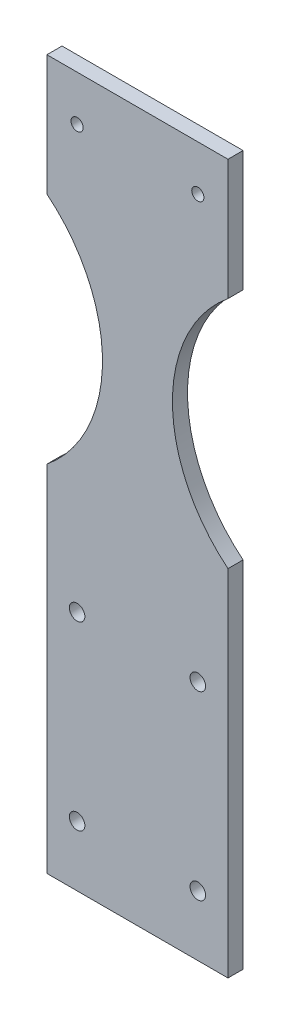
ISO-10303-21;
HEADER;
FILE_DESCRIPTION(('STEP AP214'),'2;1');
FILE_NAME('part.step','',(''),(''),'','','');
FILE_SCHEMA(('AUTOMOTIVE_DESIGN { 1 0 10303 214 1 1 1 1 }'));
ENDSEC;
DATA;
#1=APPLICATION_CONTEXT('core data for automotive mechanical design processes');
#2=APPLICATION_PROTOCOL_DEFINITION('international standard','automotive_design',2000,#1);
#3=PRODUCT_CONTEXT('',#1,'mechanical');
#4=PRODUCT('Part','Part','',(#3));
#5=PRODUCT_RELATED_PRODUCT_CATEGORY('part','',(#4));
#6=PRODUCT_DEFINITION_FORMATION('','',#4);
#7=PRODUCT_DEFINITION_CONTEXT('part definition',#1,'design');
#8=PRODUCT_DEFINITION('design','',#6,#7);
#9=PRODUCT_DEFINITION_SHAPE('','',#8);
#10=(LENGTH_UNIT() NAMED_UNIT(*) SI_UNIT(.MILLI.,.METRE.));
#11=(NAMED_UNIT(*) PLANE_ANGLE_UNIT() SI_UNIT($,.RADIAN.));
#12=(NAMED_UNIT(*) SI_UNIT($,.STERADIAN.) SOLID_ANGLE_UNIT());
#13=UNCERTAINTY_MEASURE_WITH_UNIT(LENGTH_MEASURE(1.E-05),#10,'distance_accuracy_value','');
#14=(GEOMETRIC_REPRESENTATION_CONTEXT(3) GLOBAL_UNCERTAINTY_ASSIGNED_CONTEXT((#13)) GLOBAL_UNIT_ASSIGNED_CONTEXT((#10,
#11,#12)) REPRESENTATION_CONTEXT('',''));
#15=CARTESIAN_POINT('',(0.,0.,0.));
#16=DIRECTION('',(0.,0.,1.));
#17=DIRECTION('',(1.,0.,0.));
#18=AXIS2_PLACEMENT_3D('',#15,#16,#17);
#19=CARTESIAN_POINT('',(-38.1,-149.225,6.35));
#20=DIRECTION('',(1.,0.,0.));
#21=DIRECTION('',(0.,0.,-1.));
#22=AXIS2_PLACEMENT_3D('',#19,#20,#21);
#23=PLANE('',#22);
#24=DIRECTION('',(0.,-1.,0.));
#25=VECTOR('',#24,1.);
#26=CARTESIAN_POINT('',(-38.1,-149.225,6.35));
#27=LINE('',#26,#25);
#28=CARTESIAN_POINT('',(-38.1,0.,6.35));
#29=VERTEX_POINT('',#28);
#30=CARTESIAN_POINT('',(-38.1,-149.225,6.35));
#31=VERTEX_POINT('',#30);
#32=EDGE_CURVE('E109',#29,#31,#27,.T.);
#33=ORIENTED_EDGE('',*,*,#32,.F.);
#34=DIRECTION('',(0.,0.,-1.));
#35=VECTOR('',#34,1.);
#36=CARTESIAN_POINT('',(-38.1,0.,6.35));
#37=LINE('',#36,#35);
#38=CARTESIAN_POINT('',(-38.1,0.,0.));
#39=VERTEX_POINT('',#38);
#40=EDGE_CURVE('E97',#29,#39,#37,.T.);
#41=ORIENTED_EDGE('',*,*,#40,.T.);
#42=DIRECTION('',(0.,-1.,0.));
#43=VECTOR('',#42,1.);
#44=CARTESIAN_POINT('',(-38.1,-149.225,0.));
#45=LINE('',#44,#43);
#46=CARTESIAN_POINT('',(-38.1,-149.225,0.));
#47=VERTEX_POINT('',#46);
#48=EDGE_CURVE('E132',#39,#47,#45,.T.);
#49=ORIENTED_EDGE('',*,*,#48,.T.);
#50=DIRECTION('',(0.,0.,-1.));
#51=VECTOR('',#50,1.);
#52=CARTESIAN_POINT('',(-38.1,-149.225,6.35));
#53=LINE('',#52,#51);
#54=EDGE_CURVE('E115',#31,#47,#53,.T.);
#55=ORIENTED_EDGE('',*,*,#54,.F.);
#56=EDGE_LOOP('',(#33,#41,#49,#55));
#57=FACE_BOUND('',#56,.T.);
#58=ADVANCED_FACE('F34',(#57),#23,.F.);
#59=CARTESIAN_POINT('',(38.1,-149.225,6.35));
#60=DIRECTION('',(-1.,0.,0.));
#61=DIRECTION('',(0.,0.,1.));
#62=AXIS2_PLACEMENT_3D('',#59,#60,#61);
#63=PLANE('',#62);
#64=DIRECTION('',(0.,1.,0.));
#65=VECTOR('',#64,1.);
#66=CARTESIAN_POINT('',(38.1,-149.225,6.35));
#67=LINE('',#66,#65);
#68=CARTESIAN_POINT('',(38.1000000000001,98.425,6.35));
#69=VERTEX_POINT('',#68);
#70=CARTESIAN_POINT('',(38.1,149.225,6.35));
#71=VERTEX_POINT('',#70);
#72=EDGE_CURVE('E138',#69,#71,#67,.T.);
#73=ORIENTED_EDGE('',*,*,#72,.F.);
#74=DIRECTION('',(0.,0.,-1.));
#75=VECTOR('',#74,1.);
#76=CARTESIAN_POINT('',(38.1000000000001,98.425,6.35));
#77=LINE('',#76,#75);
#78=CARTESIAN_POINT('',(38.1000000000001,98.425,0.));
#79=VERTEX_POINT('',#78);
#80=EDGE_CURVE('E165',#69,#79,#77,.T.);
#81=ORIENTED_EDGE('',*,*,#80,.T.);
#82=DIRECTION('',(0.,1.,0.));
#83=VECTOR('',#82,1.);
#84=CARTESIAN_POINT('',(38.1,-149.225,0.));
#85=LINE('',#84,#83);
#86=CARTESIAN_POINT('',(38.1,149.225,0.));
#87=VERTEX_POINT('',#86);
#88=EDGE_CURVE('E130',#79,#87,#85,.T.);
#89=ORIENTED_EDGE('',*,*,#88,.T.);
#90=DIRECTION('',(0.,0.,-1.));
#91=VECTOR('',#90,1.);
#92=CARTESIAN_POINT('',(38.1,149.225,6.35));
#93=LINE('',#92,#91);
#94=EDGE_CURVE('E11',#71,#87,#93,.T.);
#95=ORIENTED_EDGE('',*,*,#94,.F.);
#96=EDGE_LOOP('',(#73,#81,#89,#95));
#97=FACE_BOUND('',#96,.T.);
#98=ADVANCED_FACE('F187',(#97),#63,.F.);
#99=CARTESIAN_POINT('',(38.1,-149.225,0.));
#100=VERTEX_POINT('',#99);
#101=CARTESIAN_POINT('',(38.1,0.,0.));
#102=VERTEX_POINT('',#101);
#103=EDGE_CURVE('E126',#100,#102,#85,.T.);
#104=ORIENTED_EDGE('',*,*,#103,.T.);
#105=DIRECTION('',(0.,0.,-1.));
#106=VECTOR('',#105,1.);
#107=CARTESIAN_POINT('',(38.1,0.,6.35));
#108=LINE('',#107,#106);
#109=CARTESIAN_POINT('',(38.1,0.,6.35));
#110=VERTEX_POINT('',#109);
#111=EDGE_CURVE('E57',#110,#102,#108,.T.);
#112=ORIENTED_EDGE('',*,*,#111,.F.);
#113=CARTESIAN_POINT('',(38.1,-149.225,6.35));
#114=VERTEX_POINT('',#113);
#115=EDGE_CURVE('E120',#114,#110,#67,.T.);
#116=ORIENTED_EDGE('',*,*,#115,.F.);
#117=DIRECTION('',(0.,0.,-1.));
#118=VECTOR('',#117,1.);
#119=CARTESIAN_POINT('',(38.1,-149.225,6.35));
#120=LINE('',#119,#118);
#121=EDGE_CURVE('E125',#114,#100,#120,.T.);
#122=ORIENTED_EDGE('',*,*,#121,.T.);
#123=EDGE_LOOP('',(#104,#112,#116,#122));
#124=FACE_BOUND('',#123,.T.);
#125=ADVANCED_FACE('F36',(#124),#63,.F.);
#126=CARTESIAN_POINT('',(-38.1,149.225,6.35));
#127=DIRECTION('',(0.,-1.,0.));
#128=DIRECTION('',(0.,0.,-1.));
#129=AXIS2_PLACEMENT_3D('',#126,#127,#128);
#130=PLANE('',#129);
#131=DIRECTION('',(-1.,0.,0.));
#132=VECTOR('',#131,1.);
#133=CARTESIAN_POINT('',(-38.1,149.225,0.));
#134=LINE('',#133,#132);
#135=CARTESIAN_POINT('',(-38.1,149.225,0.));
#136=VERTEX_POINT('',#135);
#137=EDGE_CURVE('E129',#87,#136,#134,.T.);
#138=ORIENTED_EDGE('',*,*,#137,.T.);
#139=DIRECTION('',(0.,0.,-1.));
#140=VECTOR('',#139,1.);
#141=CARTESIAN_POINT('',(-38.1,149.225,6.35));
#142=LINE('',#141,#140);
#143=CARTESIAN_POINT('',(-38.1,149.225,6.35));
#144=VERTEX_POINT('',#143);
#145=EDGE_CURVE('E42',#144,#136,#142,.T.);
#146=ORIENTED_EDGE('',*,*,#145,.F.);
#147=DIRECTION('',(-1.,0.,0.));
#148=VECTOR('',#147,1.);
#149=CARTESIAN_POINT('',(-38.1,149.225,6.35));
#150=LINE('',#149,#148);
#151=EDGE_CURVE('E117',#71,#144,#150,.T.);
#152=ORIENTED_EDGE('',*,*,#151,.F.);
#153=ORIENTED_EDGE('',*,*,#94,.T.);
#154=EDGE_LOOP('',(#138,#146,#152,#153));
#155=FACE_BOUND('',#154,.T.);
#156=ADVANCED_FACE('F186',(#155),#130,.F.);
#157=CARTESIAN_POINT('',(-38.1,98.425,0.));
#158=VERTEX_POINT('',#157);
#159=EDGE_CURVE('E133',#136,#158,#45,.T.);
#160=ORIENTED_EDGE('',*,*,#159,.T.);
#161=DIRECTION('',(0.,0.,-1.));
#162=VECTOR('',#161,1.);
#163=CARTESIAN_POINT('',(-38.1,98.425,6.35));
#164=LINE('',#163,#162);
#165=CARTESIAN_POINT('',(-38.1,98.425,6.35));
#166=VERTEX_POINT('',#165);
#167=EDGE_CURVE('E49',#166,#158,#164,.T.);
#168=ORIENTED_EDGE('',*,*,#167,.F.);
#169=EDGE_CURVE('E112',#144,#166,#27,.T.);
#170=ORIENTED_EDGE('',*,*,#169,.F.);
#171=ORIENTED_EDGE('',*,*,#145,.T.);
#172=EDGE_LOOP('',(#160,#168,#170,#171));
#173=FACE_BOUND('',#172,.T.);
#174=ADVANCED_FACE('F145',(#173),#23,.F.);
#175=CARTESIAN_POINT('',(-38.1,-149.225,6.35));
#176=DIRECTION('',(0.,1.,0.));
#177=DIRECTION('',(0.,0.,1.));
#178=AXIS2_PLACEMENT_3D('',#175,#176,#177);
#179=PLANE('',#178);
#180=DIRECTION('',(1.,0.,0.));
#181=VECTOR('',#180,1.);
#182=CARTESIAN_POINT('',(-38.1,-149.225,0.));
#183=LINE('',#182,#181);
#184=EDGE_CURVE('E136',#47,#100,#183,.T.);
#185=ORIENTED_EDGE('',*,*,#184,.T.);
#186=ORIENTED_EDGE('',*,*,#121,.F.);
#187=DIRECTION('',(1.,0.,0.));
#188=VECTOR('',#187,1.);
#189=CARTESIAN_POINT('',(-38.1,-149.225,6.35));
#190=LINE('',#189,#188);
#191=EDGE_CURVE('E119',#31,#114,#190,.T.);
#192=ORIENTED_EDGE('',*,*,#191,.F.);
#193=ORIENTED_EDGE('',*,*,#54,.T.);
#194=EDGE_LOOP('',(#185,#186,#192,#193));
#195=FACE_BOUND('',#194,.T.);
#196=ADVANCED_FACE('F192',(#195),#179,.F.);
#197=CARTESIAN_POINT('',(0.,0.,6.35));
#198=DIRECTION('',(0.,0.,-1.));
#199=DIRECTION('',(-1.,0.,0.));
#200=AXIS2_PLACEMENT_3D('',#197,#198,#199);
#201=PLANE('',#200);
#202=CARTESIAN_POINT('',(25.4,-47.625,6.35));
#203=DIRECTION('',(0.,0.,-1.));
#204=DIRECTION('',(-1.,0.,0.));
#205=AXIS2_PLACEMENT_3D('',#202,#203,#204);
#206=CIRCLE('',#205,3.2639);
#207=CARTESIAN_POINT('',(22.1361,-47.625,6.35));
#208=VERTEX_POINT('',#207);
#209=EDGE_CURVE('E337',#208,#208,#206,.T.);
#210=ORIENTED_EDGE('',*,*,#209,.T.);
#211=EDGE_LOOP('',(#210));
#212=FACE_BOUND('',#211,.T.);
#213=CARTESIAN_POINT('',(-25.4000000000001,-47.625,6.35));
#214=DIRECTION('',(0.,0.,-1.));
#215=DIRECTION('',(-1.,0.,0.));
#216=AXIS2_PLACEMENT_3D('',#213,#214,#215);
#217=CIRCLE('',#216,3.2639);
#218=CARTESIAN_POINT('',(-28.6639000000001,-47.625,6.35));
#219=VERTEX_POINT('',#218);
#220=EDGE_CURVE('E347',#219,#219,#217,.T.);
#221=ORIENTED_EDGE('',*,*,#220,.T.);
#222=EDGE_LOOP('',(#221));
#223=FACE_BOUND('',#222,.T.);
#224=CARTESIAN_POINT('',(-25.4000000000001,-123.825,6.35));
#225=DIRECTION('',(0.,0.,-1.));
#226=DIRECTION('',(-1.,0.,0.));
#227=AXIS2_PLACEMENT_3D('',#224,#225,#226);
#228=CIRCLE('',#227,3.2639);
#229=CARTESIAN_POINT('',(-28.6639000000001,-123.825,6.35));
#230=VERTEX_POINT('',#229);
#231=EDGE_CURVE('E353',#230,#230,#228,.T.);
#232=ORIENTED_EDGE('',*,*,#231,.T.);
#233=EDGE_LOOP('',(#232));
#234=FACE_BOUND('',#233,.T.);
#235=CARTESIAN_POINT('',(25.4,-123.825,6.35));
#236=DIRECTION('',(0.,0.,-1.));
#237=DIRECTION('',(-1.,0.,0.));
#238=AXIS2_PLACEMENT_3D('',#235,#236,#237);
#239=CIRCLE('',#238,3.2639);
#240=CARTESIAN_POINT('',(22.1361,-123.825,6.35));
#241=VERTEX_POINT('',#240);
#242=EDGE_CURVE('E154',#241,#241,#239,.T.);
#243=ORIENTED_EDGE('',*,*,#242,.T.);
#244=EDGE_LOOP('',(#243));
#245=FACE_BOUND('',#244,.T.);
#246=CARTESIAN_POINT('',(25.4,130.175,6.35));
#247=DIRECTION('',(0.,0.,-1.));
#248=DIRECTION('',(-1.,0.,0.));
#249=AXIS2_PLACEMENT_3D('',#246,#247,#248);
#250=CIRCLE('',#249,2.55269999999999);
#251=CARTESIAN_POINT('',(22.8473,130.175,6.35));
#252=VERTEX_POINT('',#251);
#253=EDGE_CURVE('E173',#252,#252,#250,.T.);
#254=ORIENTED_EDGE('',*,*,#253,.T.);
#255=EDGE_LOOP('',(#254));
#256=FACE_BOUND('',#255,.T.);
#257=CARTESIAN_POINT('',(-25.4,130.175,6.35));
#258=DIRECTION('',(0.,0.,-1.));
#259=DIRECTION('',(-1.,0.,0.));
#260=AXIS2_PLACEMENT_3D('',#257,#258,#259);
#261=CIRCLE('',#260,2.55269999999999);
#262=CARTESIAN_POINT('',(-27.9527,130.175,6.35));
#263=VERTEX_POINT('',#262);
#264=EDGE_CURVE('E179',#263,#263,#261,.T.);
#265=ORIENTED_EDGE('',*,*,#264,.T.);
#266=EDGE_LOOP('',(#265));
#267=FACE_BOUND('',#266,.T.);
#268=ORIENTED_EDGE('',*,*,#169,.T.);
#269=CARTESIAN_POINT('',(-78.2295382947524,49.2125,6.35));
#270=DIRECTION('',(0.,0.,-1.));
#271=DIRECTION('',(-1.,0.,0.));
#272=AXIS2_PLACEMENT_3D('',#269,#270,#271);
#273=CIRCLE('',#272,63.5);
#274=EDGE_CURVE('E100',#166,#29,#273,.T.);
#275=ORIENTED_EDGE('',*,*,#274,.T.);
#276=ORIENTED_EDGE('',*,*,#32,.T.);
#277=ORIENTED_EDGE('',*,*,#191,.T.);
#278=ORIENTED_EDGE('',*,*,#115,.T.);
#279=CARTESIAN_POINT('',(78.2295382947525,49.2125,6.35));
#280=DIRECTION('',(0.,0.,-1.));
#281=DIRECTION('',(1.,0.,0.));
#282=AXIS2_PLACEMENT_3D('',#279,#280,#281);
#283=CIRCLE('',#282,63.5);
#284=EDGE_CURVE('E162',#110,#69,#283,.T.);
#285=ORIENTED_EDGE('',*,*,#284,.T.);
#286=ORIENTED_EDGE('',*,*,#72,.T.);
#287=ORIENTED_EDGE('',*,*,#151,.T.);
#288=EDGE_LOOP('',(#268,#275,#276,#277,#278,#285,#286,#287));
#289=FACE_BOUND('',#288,.T.);
#290=ADVANCED_FACE('F108',(#212,#223,#234,#245,#256,#267,#289),#201,.F.);
#291=CARTESIAN_POINT('',(0.,0.,0.));
#292=DIRECTION('',(0.,0.,-1.));
#293=DIRECTION('',(-1.,0.,0.));
#294=AXIS2_PLACEMENT_3D('',#291,#292,#293);
#295=PLANE('',#294);
#296=CARTESIAN_POINT('',(25.4,-47.625,0.));
#297=DIRECTION('',(0.,0.,-1.));
#298=DIRECTION('',(-1.,0.,0.));
#299=AXIS2_PLACEMENT_3D('',#296,#297,#298);
#300=CIRCLE('',#299,3.2639);
#301=CARTESIAN_POINT('',(22.1361,-47.625,0.));
#302=VERTEX_POINT('',#301);
#303=EDGE_CURVE('E340',#302,#302,#300,.T.);
#304=ORIENTED_EDGE('',*,*,#303,.F.);
#305=EDGE_LOOP('',(#304));
#306=FACE_BOUND('',#305,.T.);
#307=CARTESIAN_POINT('',(-25.4000000000001,-47.625,0.));
#308=DIRECTION('',(0.,0.,-1.));
#309=DIRECTION('',(-1.,0.,0.));
#310=AXIS2_PLACEMENT_3D('',#307,#308,#309);
#311=CIRCLE('',#310,3.2639);
#312=CARTESIAN_POINT('',(-28.6639000000001,-47.625,0.));
#313=VERTEX_POINT('',#312);
#314=EDGE_CURVE('E342',#313,#313,#311,.T.);
#315=ORIENTED_EDGE('',*,*,#314,.F.);
#316=EDGE_LOOP('',(#315));
#317=FACE_BOUND('',#316,.T.);
#318=CARTESIAN_POINT('',(-25.4000000000001,-123.825,0.));
#319=DIRECTION('',(0.,0.,-1.));
#320=DIRECTION('',(-1.,0.,0.));
#321=AXIS2_PLACEMENT_3D('',#318,#319,#320);
#322=CIRCLE('',#321,3.2639);
#323=CARTESIAN_POINT('',(-28.6639000000001,-123.825,0.));
#324=VERTEX_POINT('',#323);
#325=EDGE_CURVE('E350',#324,#324,#322,.T.);
#326=ORIENTED_EDGE('',*,*,#325,.F.);
#327=EDGE_LOOP('',(#326));
#328=FACE_BOUND('',#327,.T.);
#329=CARTESIAN_POINT('',(25.4,-123.825,0.));
#330=DIRECTION('',(0.,0.,-1.));
#331=DIRECTION('',(-1.,0.,0.));
#332=AXIS2_PLACEMENT_3D('',#329,#330,#331);
#333=CIRCLE('',#332,3.2639);
#334=CARTESIAN_POINT('',(22.1361,-123.825,0.));
#335=VERTEX_POINT('',#334);
#336=EDGE_CURVE('E157',#335,#335,#333,.T.);
#337=ORIENTED_EDGE('',*,*,#336,.F.);
#338=EDGE_LOOP('',(#337));
#339=FACE_BOUND('',#338,.T.);
#340=CARTESIAN_POINT('',(-78.2295382947524,49.2125,0.));
#341=DIRECTION('',(0.,0.,-1.));
#342=DIRECTION('',(-1.,0.,0.));
#343=AXIS2_PLACEMENT_3D('',#340,#341,#342);
#344=CIRCLE('',#343,63.5);
#345=EDGE_CURVE('E101',#158,#39,#344,.T.);
#346=ORIENTED_EDGE('',*,*,#345,.F.);
#347=ORIENTED_EDGE('',*,*,#159,.F.);
#348=ORIENTED_EDGE('',*,*,#137,.F.);
#349=ORIENTED_EDGE('',*,*,#88,.F.);
#350=CARTESIAN_POINT('',(78.2295382947525,49.2125,0.));
#351=DIRECTION('',(0.,0.,-1.));
#352=DIRECTION('',(1.,0.,0.));
#353=AXIS2_PLACEMENT_3D('',#350,#351,#352);
#354=CIRCLE('',#353,63.5);
#355=EDGE_CURVE('E160',#102,#79,#354,.T.);
#356=ORIENTED_EDGE('',*,*,#355,.F.);
#357=ORIENTED_EDGE('',*,*,#103,.F.);
#358=ORIENTED_EDGE('',*,*,#184,.F.);
#359=ORIENTED_EDGE('',*,*,#48,.F.);
#360=EDGE_LOOP('',(#346,#347,#348,#349,#356,#357,#358,#359));
#361=FACE_BOUND('',#360,.T.);
#362=CARTESIAN_POINT('',(25.4,130.175,0.));
#363=DIRECTION('',(0.,0.,-1.));
#364=DIRECTION('',(-1.,0.,0.));
#365=AXIS2_PLACEMENT_3D('',#362,#363,#364);
#366=CIRCLE('',#365,2.55269999999999);
#367=CARTESIAN_POINT('',(22.8473,130.175,0.));
#368=VERTEX_POINT('',#367);
#369=EDGE_CURVE('E168',#368,#368,#366,.T.);
#370=ORIENTED_EDGE('',*,*,#369,.F.);
#371=EDGE_LOOP('',(#370));
#372=FACE_BOUND('',#371,.T.);
#373=CARTESIAN_POINT('',(-25.4,130.175,0.));
#374=DIRECTION('',(0.,0.,-1.));
#375=DIRECTION('',(-1.,0.,0.));
#376=AXIS2_PLACEMENT_3D('',#373,#374,#375);
#377=CIRCLE('',#376,2.55269999999999);
#378=CARTESIAN_POINT('',(-27.9527,130.175,0.));
#379=VERTEX_POINT('',#378);
#380=EDGE_CURVE('E176',#379,#379,#377,.T.);
#381=ORIENTED_EDGE('',*,*,#380,.F.);
#382=EDGE_LOOP('',(#381));
#383=FACE_BOUND('',#382,.T.);
#384=ADVANCED_FACE('F150',(#306,#317,#328,#339,#361,#372,#383),#295,.T.);
#385=CARTESIAN_POINT('',(-25.4,130.175,0.));
#386=DIRECTION('',(0.,0.,-1.));
#387=DIRECTION('',(-1.,0.,0.));
#388=AXIS2_PLACEMENT_3D('',#385,#386,#387);
#389=CYLINDRICAL_SURFACE('',#388,2.55269999999999);
#390=ORIENTED_EDGE('',*,*,#264,.F.);
#391=EDGE_LOOP('',(#390));
#392=FACE_BOUND('',#391,.T.);
#393=ORIENTED_EDGE('',*,*,#380,.T.);
#394=EDGE_LOOP('',(#393));
#395=FACE_BOUND('',#394,.T.);
#396=ADVANCED_FACE('F235',(#392,#395),#389,.F.);
#397=CARTESIAN_POINT('',(25.4,130.175,0.));
#398=DIRECTION('',(0.,0.,-1.));
#399=DIRECTION('',(-1.,0.,0.));
#400=AXIS2_PLACEMENT_3D('',#397,#398,#399);
#401=CYLINDRICAL_SURFACE('',#400,2.55269999999999);
#402=ORIENTED_EDGE('',*,*,#253,.F.);
#403=EDGE_LOOP('',(#402));
#404=FACE_BOUND('',#403,.T.);
#405=ORIENTED_EDGE('',*,*,#369,.T.);
#406=EDGE_LOOP('',(#405));
#407=FACE_BOUND('',#406,.T.);
#408=ADVANCED_FACE('F229',(#404,#407),#401,.F.);
#409=CARTESIAN_POINT('',(78.2295382947525,49.2125,6.35));
#410=DIRECTION('',(0.,0.,-1.));
#411=DIRECTION('',(-1.,0.,0.));
#412=AXIS2_PLACEMENT_3D('',#409,#410,#411);
#413=CYLINDRICAL_SURFACE('',#412,63.5);
#414=ORIENTED_EDGE('',*,*,#355,.T.);
#415=ORIENTED_EDGE('',*,*,#80,.F.);
#416=ORIENTED_EDGE('',*,*,#284,.F.);
#417=ORIENTED_EDGE('',*,*,#111,.T.);
#418=EDGE_LOOP('',(#414,#415,#416,#417));
#419=FACE_BOUND('',#418,.T.);
#420=ADVANCED_FACE('F234',(#419),#413,.F.);
#421=CARTESIAN_POINT('',(-78.2295382947524,49.2125,6.35));
#422=DIRECTION('',(0.,0.,-1.));
#423=DIRECTION('',(-1.,0.,0.));
#424=AXIS2_PLACEMENT_3D('',#421,#422,#423);
#425=CYLINDRICAL_SURFACE('',#424,63.5);
#426=ORIENTED_EDGE('',*,*,#345,.T.);
#427=ORIENTED_EDGE('',*,*,#40,.F.);
#428=ORIENTED_EDGE('',*,*,#274,.F.);
#429=ORIENTED_EDGE('',*,*,#167,.T.);
#430=EDGE_LOOP('',(#426,#427,#428,#429));
#431=FACE_BOUND('',#430,.T.);
#432=ADVANCED_FACE('F99',(#431),#425,.F.);
#433=CARTESIAN_POINT('',(25.4,-123.825,0.));
#434=DIRECTION('',(0.,0.,-1.));
#435=DIRECTION('',(-1.,0.,0.));
#436=AXIS2_PLACEMENT_3D('',#433,#434,#435);
#437=CYLINDRICAL_SURFACE('',#436,3.2639);
#438=ORIENTED_EDGE('',*,*,#242,.F.);
#439=EDGE_LOOP('',(#438));
#440=FACE_BOUND('',#439,.T.);
#441=ORIENTED_EDGE('',*,*,#336,.T.);
#442=EDGE_LOOP('',(#441));
#443=FACE_BOUND('',#442,.T.);
#444=ADVANCED_FACE('F279',(#440,#443),#437,.F.);
#445=CARTESIAN_POINT('',(-25.4000000000001,-123.825,0.));
#446=DIRECTION('',(0.,0.,-1.));
#447=DIRECTION('',(-1.,0.,0.));
#448=AXIS2_PLACEMENT_3D('',#445,#446,#447);
#449=CYLINDRICAL_SURFACE('',#448,3.2639);
#450=ORIENTED_EDGE('',*,*,#231,.F.);
#451=EDGE_LOOP('',(#450));
#452=FACE_BOUND('',#451,.T.);
#453=ORIENTED_EDGE('',*,*,#325,.T.);
#454=EDGE_LOOP('',(#453));
#455=FACE_BOUND('',#454,.T.);
#456=ADVANCED_FACE('F300',(#452,#455),#449,.F.);
#457=CARTESIAN_POINT('',(-25.4000000000001,-47.625,0.));
#458=DIRECTION('',(0.,0.,-1.));
#459=DIRECTION('',(-1.,0.,0.));
#460=AXIS2_PLACEMENT_3D('',#457,#458,#459);
#461=CYLINDRICAL_SURFACE('',#460,3.2639);
#462=ORIENTED_EDGE('',*,*,#220,.F.);
#463=EDGE_LOOP('',(#462));
#464=FACE_BOUND('',#463,.T.);
#465=ORIENTED_EDGE('',*,*,#314,.T.);
#466=EDGE_LOOP('',(#465));
#467=FACE_BOUND('',#466,.T.);
#468=ADVANCED_FACE('F310',(#464,#467),#461,.F.);
#469=CARTESIAN_POINT('',(25.4,-47.625,0.));
#470=DIRECTION('',(0.,0.,-1.));
#471=DIRECTION('',(-1.,0.,0.));
#472=AXIS2_PLACEMENT_3D('',#469,#470,#471);
#473=CYLINDRICAL_SURFACE('',#472,3.2639);
#474=ORIENTED_EDGE('',*,*,#209,.F.);
#475=EDGE_LOOP('',(#474));
#476=FACE_BOUND('',#475,.T.);
#477=ORIENTED_EDGE('',*,*,#303,.T.);
#478=EDGE_LOOP('',(#477));
#479=FACE_BOUND('',#478,.T.);
#480=ADVANCED_FACE('F320',(#476,#479),#473,.F.);
#481=CLOSED_SHELL('',(#58,#98,#125,#156,#174,#196,#290,#384,#396,#408,#420,#432,#444,#456,#468,#480));
#482=MANIFOLD_SOLID_BREP('B2',#481);
#483=ADVANCED_BREP_SHAPE_REPRESENTATION('',(#18,#482),#14);
#484=SHAPE_DEFINITION_REPRESENTATION(#9,#483);
ENDSEC;
END-ISO-10303-21;
